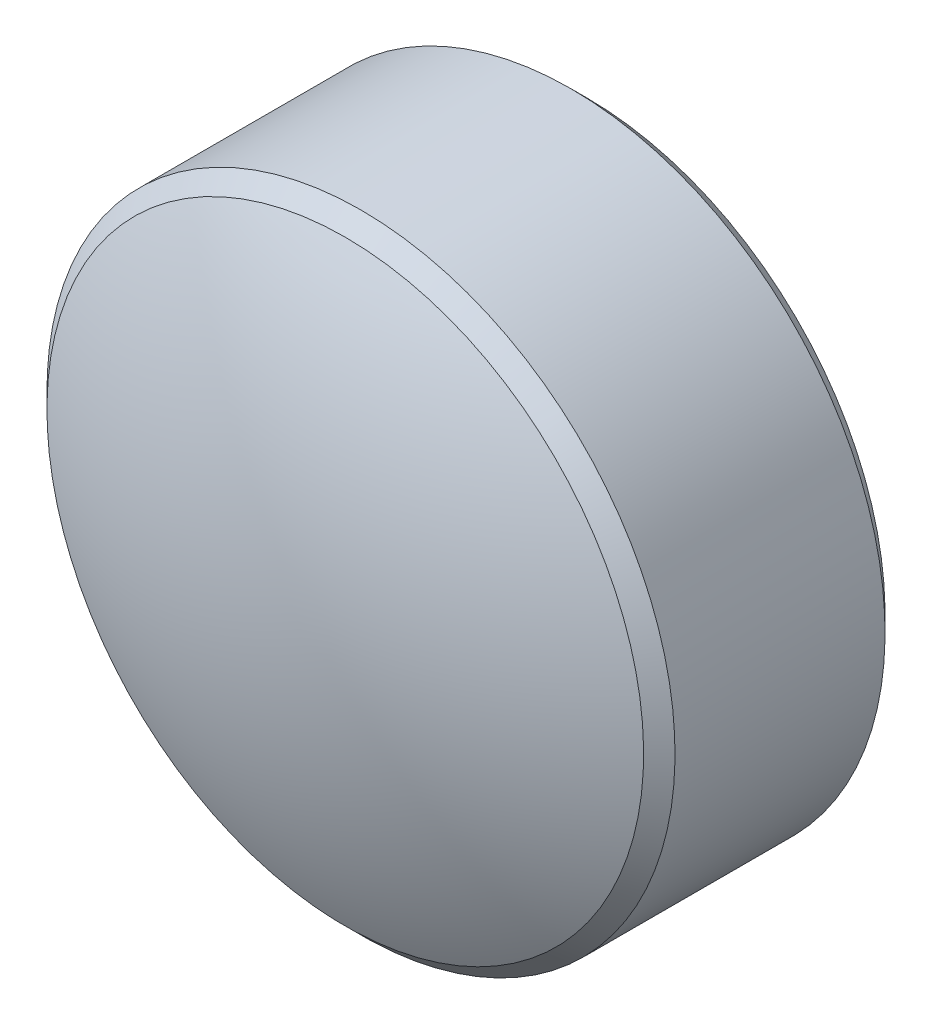
ISO-10303-21;
HEADER;
FILE_DESCRIPTION(('STEP AP214'),'2;1');
FILE_NAME('part.step','',(''),(''),'','','');
FILE_SCHEMA(('AUTOMOTIVE_DESIGN { 1 0 10303 214 1 1 1 1 }'));
ENDSEC;
DATA;
#1=APPLICATION_CONTEXT('core data for automotive mechanical design processes');
#2=APPLICATION_PROTOCOL_DEFINITION('international standard','automotive_design',2000,#1);
#3=PRODUCT_CONTEXT('',#1,'mechanical');
#4=PRODUCT('Part','Part','',(#3));
#5=PRODUCT_RELATED_PRODUCT_CATEGORY('part','',(#4));
#6=PRODUCT_DEFINITION_FORMATION('','',#4);
#7=PRODUCT_DEFINITION_CONTEXT('part definition',#1,'design');
#8=PRODUCT_DEFINITION('design','',#6,#7);
#9=PRODUCT_DEFINITION_SHAPE('','',#8);
#10=(LENGTH_UNIT() NAMED_UNIT(*) SI_UNIT(.MILLI.,.METRE.));
#11=(NAMED_UNIT(*) PLANE_ANGLE_UNIT() SI_UNIT($,.RADIAN.));
#12=(NAMED_UNIT(*) SI_UNIT($,.STERADIAN.) SOLID_ANGLE_UNIT());
#13=UNCERTAINTY_MEASURE_WITH_UNIT(LENGTH_MEASURE(1.E-05),#10,'distance_accuracy_value','');
#14=(GEOMETRIC_REPRESENTATION_CONTEXT(3) GLOBAL_UNCERTAINTY_ASSIGNED_CONTEXT((#13)) GLOBAL_UNIT_ASSIGNED_CONTEXT((#10,
#11,#12)) REPRESENTATION_CONTEXT('',''));
#15=CARTESIAN_POINT('',(0.,0.,0.));
#16=DIRECTION('',(0.,0.,1.));
#17=DIRECTION('',(1.,0.,0.));
#18=AXIS2_PLACEMENT_3D('',#15,#16,#17);
#19=CARTESIAN_POINT('',(0.660603214279336,1.30595866412193,0.902353884332434));
#20=DIRECTION('',(0.,0.,-1.));
#21=DIRECTION('',(0.,1.,0.));
#22=AXIS2_PLACEMENT_3D('',#19,#20,#21);
#23=PLANE('',#22);
#24=CARTESIAN_POINT('',(0.660603214279336,1.30595866412193,0.902353884332434));
#25=DIRECTION('',(0.,0.,-1.));
#26=DIRECTION('',(0.,1.,0.));
#27=AXIS2_PLACEMENT_3D('',#24,#25,#26);
#28=CIRCLE('',#27,0.949999999999999);
#29=CARTESIAN_POINT('',(0.660603214279336,2.25595866412193,0.902353884332434));
#30=VERTEX_POINT('',#29);
#31=EDGE_CURVE('E20',#30,#30,#28,.T.);
#32=ORIENTED_EDGE('',*,*,#31,.T.);
#33=EDGE_LOOP('',(#32));
#34=FACE_BOUND('',#33,.T.);
#35=ADVANCED_FACE('F13',(#34),#23,.T.);
#36=CARTESIAN_POINT('',(0.660603214279336,1.30595866412193,0.902353884332434));
#37=DIRECTION('',(0.,0.,-1.));
#38=DIRECTION('',(0.,1.,0.));
#39=AXIS2_PLACEMENT_3D('',#36,#37,#38);
#40=CYLINDRICAL_SURFACE('',#39,1.);
#41=CARTESIAN_POINT('',(0.660603214279336,1.30595866412193,0.952353884332434));
#42=DIRECTION('',(0.,0.,-1.));
#43=DIRECTION('',(0.,1.,0.));
#44=AXIS2_PLACEMENT_3D('',#41,#42,#43);
#45=CIRCLE('',#44,1.);
#46=CARTESIAN_POINT('',(0.660603214279336,2.30595866412193,0.952353884332434));
#47=VERTEX_POINT('',#46);
#48=EDGE_CURVE('E9',#47,#47,#45,.F.);
#49=ORIENTED_EDGE('',*,*,#48,.T.);
#50=EDGE_LOOP('',(#49));
#51=FACE_BOUND('',#50,.T.);
#52=CARTESIAN_POINT('',(0.660603214279336,1.30595866412193,1.62110686335766));
#53=DIRECTION('',(0.,0.,-1.));
#54=DIRECTION('',(0.,1.,0.));
#55=AXIS2_PLACEMENT_3D('',#52,#53,#54);
#56=CIRCLE('',#55,1.);
#57=CARTESIAN_POINT('',(0.660603214279336,2.30595866412193,1.62110686335766));
#58=VERTEX_POINT('',#57);
#59=EDGE_CURVE('E24',#58,#58,#56,.T.);
#60=ORIENTED_EDGE('',*,*,#59,.T.);
#61=EDGE_LOOP('',(#60));
#62=FACE_BOUND('',#61,.T.);
#63=ADVANCED_FACE('F46',(#51,#62),#40,.T.);
#64=CARTESIAN_POINT('',(0.660603214279336,1.30595866412193,1.62110686335766));
#65=DIRECTION('',(0.,0.,-1.));
#66=DIRECTION('',(0.,1.,0.));
#67=AXIS2_PLACEMENT_3D('',#64,#65,#66);
#68=CONICAL_SURFACE('',#67,1.,0.785398163397447);
#69=CARTESIAN_POINT('',(0.660603214279336,1.30595866412193,1.67110686335766));
#70=DIRECTION('',(0.,0.,-1.));
#71=DIRECTION('',(0.,1.,0.));
#72=AXIS2_PLACEMENT_3D('',#69,#70,#71);
#73=CIRCLE('',#72,0.95);
#74=CARTESIAN_POINT('',(0.660603214279336,2.25595866412193,1.67110686335766));
#75=VERTEX_POINT('',#74);
#76=EDGE_CURVE('E28',#75,#75,#73,.T.);
#77=ORIENTED_EDGE('',*,*,#76,.T.);
#78=EDGE_LOOP('',(#77));
#79=FACE_BOUND('',#78,.T.);
#80=ORIENTED_EDGE('',*,*,#59,.F.);
#81=EDGE_LOOP('',(#80));
#82=FACE_BOUND('',#81,.T.);
#83=ADVANCED_FACE('F34',(#79,#82),#68,.T.);
#84=CARTESIAN_POINT('',(0.660603214279336,1.30595866412193,-0.164646115667567));
#85=DIRECTION('',(0.,0.,-1.));
#86=DIRECTION('',(0.,1.,0.));
#87=AXIS2_PLACEMENT_3D('',#84,#85,#86);
#88=SPHERICAL_SURFACE('',#87,2.067);
#89=ORIENTED_EDGE('',*,*,#76,.F.);
#90=EDGE_LOOP('',(#89));
#91=FACE_BOUND('',#90,.T.);
#92=ADVANCED_FACE('F37',(#91),#88,.T.);
#93=CARTESIAN_POINT('',(0.660603214279336,1.30595866412193,0.902353884332434));
#94=DIRECTION('',(0.,0.,1.));
#95=DIRECTION('',(0.,-1.,0.));
#96=AXIS2_PLACEMENT_3D('',#93,#94,#95);
#97=CONICAL_SURFACE('',#96,0.949999999999999,0.78539816339745);
#98=ORIENTED_EDGE('',*,*,#48,.F.);
#99=EDGE_LOOP('',(#98));
#100=FACE_BOUND('',#99,.T.);
#101=ORIENTED_EDGE('',*,*,#31,.F.);
#102=EDGE_LOOP('',(#101));
#103=FACE_BOUND('',#102,.T.);
#104=ADVANCED_FACE('F15',(#100,#103),#97,.T.);
#105=CLOSED_SHELL('',(#35,#63,#83,#92,#104));
#106=MANIFOLD_SOLID_BREP('B1',#105);
#107=ADVANCED_BREP_SHAPE_REPRESENTATION('',(#18,#106),#14);
#108=SHAPE_DEFINITION_REPRESENTATION(#9,#107);
ENDSEC;
END-ISO-10303-21;
